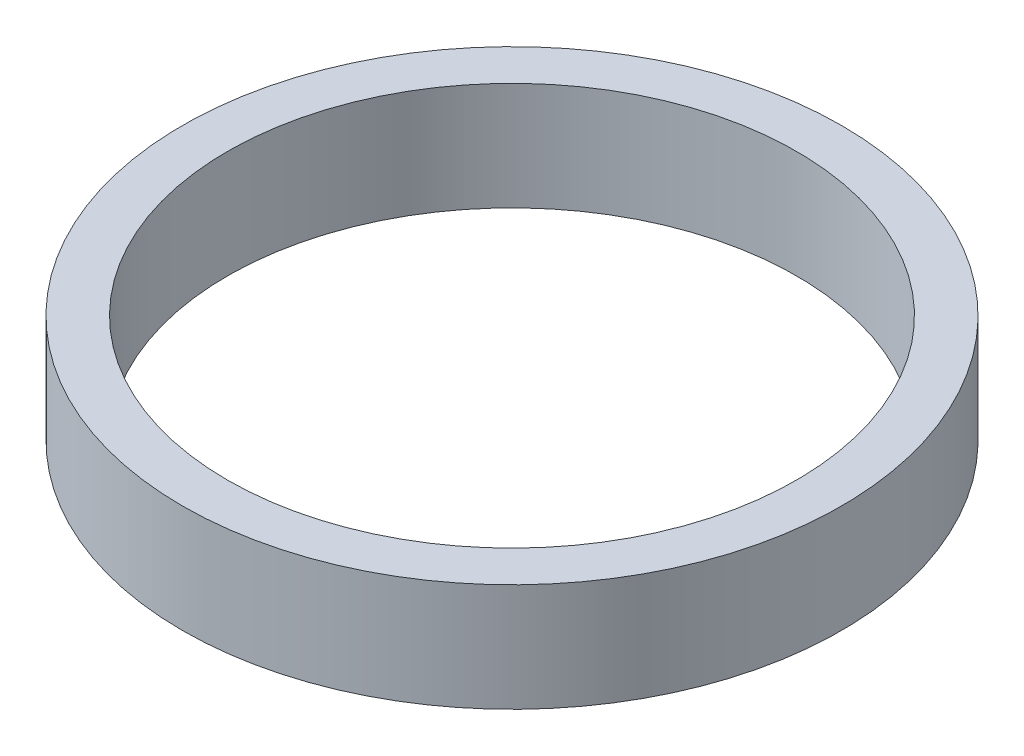
ISO-10303-21;
HEADER;
FILE_DESCRIPTION(('STEP AP214'),'2;1');
FILE_NAME('part.step','',(''),(''),'','','');
FILE_SCHEMA(('AUTOMOTIVE_DESIGN { 1 0 10303 214 1 1 1 1 }'));
ENDSEC;
DATA;
#1=APPLICATION_CONTEXT('core data for automotive mechanical design processes');
#2=APPLICATION_PROTOCOL_DEFINITION('international standard','automotive_design',2000,#1);
#3=PRODUCT_CONTEXT('',#1,'mechanical');
#4=PRODUCT('Part','Part','',(#3));
#5=PRODUCT_RELATED_PRODUCT_CATEGORY('part','',(#4));
#6=PRODUCT_DEFINITION_FORMATION('','',#4);
#7=PRODUCT_DEFINITION_CONTEXT('part definition',#1,'design');
#8=PRODUCT_DEFINITION('design','',#6,#7);
#9=PRODUCT_DEFINITION_SHAPE('','',#8);
#10=(LENGTH_UNIT() NAMED_UNIT(*) SI_UNIT(.MILLI.,.METRE.));
#11=(NAMED_UNIT(*) PLANE_ANGLE_UNIT() SI_UNIT($,.RADIAN.));
#12=(NAMED_UNIT(*) SI_UNIT($,.STERADIAN.) SOLID_ANGLE_UNIT());
#13=UNCERTAINTY_MEASURE_WITH_UNIT(LENGTH_MEASURE(1.E-05),#10,'distance_accuracy_value','');
#14=(GEOMETRIC_REPRESENTATION_CONTEXT(3) GLOBAL_UNCERTAINTY_ASSIGNED_CONTEXT((#13)) GLOBAL_UNIT_ASSIGNED_CONTEXT((#10,
#11,#12)) REPRESENTATION_CONTEXT('',''));
#15=CARTESIAN_POINT('',(0.,0.,0.));
#16=DIRECTION('',(0.,0.,1.));
#17=DIRECTION('',(1.,0.,0.));
#18=AXIS2_PLACEMENT_3D('',#15,#16,#17);
#19=CARTESIAN_POINT('',(0.,18.,0.));
#20=DIRECTION('',(0.,-1.,0.));
#21=DIRECTION('',(0.,0.,-1.));
#22=AXIS2_PLACEMENT_3D('',#19,#20,#21);
#23=CYLINDRICAL_SURFACE('',#22,55.);
#24=CARTESIAN_POINT('',(0.,18.,0.));
#25=DIRECTION('',(0.,1.,0.));
#26=DIRECTION('',(0.,0.,1.));
#27=AXIS2_PLACEMENT_3D('',#24,#25,#26);
#28=CIRCLE('',#27,55.);
#29=CARTESIAN_POINT('',(0.,18.,55.));
#30=VERTEX_POINT('',#29);
#31=EDGE_CURVE('E10',#30,#30,#28,.T.);
#32=ORIENTED_EDGE('',*,*,#31,.F.);
#33=EDGE_LOOP('',(#32));
#34=FACE_BOUND('',#33,.T.);
#35=CARTESIAN_POINT('',(0.,0.,0.));
#36=DIRECTION('',(0.,1.,0.));
#37=DIRECTION('',(0.,0.,1.));
#38=AXIS2_PLACEMENT_3D('',#35,#36,#37);
#39=CIRCLE('',#38,55.);
#40=CARTESIAN_POINT('',(0.,0.,55.));
#41=VERTEX_POINT('',#40);
#42=EDGE_CURVE('E37',#41,#41,#39,.T.);
#43=ORIENTED_EDGE('',*,*,#42,.T.);
#44=EDGE_LOOP('',(#43));
#45=FACE_BOUND('',#44,.T.);
#46=ADVANCED_FACE('F40',(#34,#45),#23,.T.);
#47=CARTESIAN_POINT('',(0.,18.,0.));
#48=DIRECTION('',(0.,1.,0.));
#49=DIRECTION('',(0.,0.,1.));
#50=AXIS2_PLACEMENT_3D('',#47,#48,#49);
#51=PLANE('',#50);
#52=CARTESIAN_POINT('',(0.,18.,0.));
#53=DIRECTION('',(0.,1.,0.));
#54=DIRECTION('',(0.,0.,1.));
#55=AXIS2_PLACEMENT_3D('',#52,#53,#54);
#56=CIRCLE('',#55,47.5);
#57=CARTESIAN_POINT('',(0.,18.,47.5));
#58=VERTEX_POINT('',#57);
#59=EDGE_CURVE('E50',#58,#58,#56,.T.);
#60=ORIENTED_EDGE('',*,*,#59,.F.);
#61=EDGE_LOOP('',(#60));
#62=FACE_BOUND('',#61,.T.);
#63=ORIENTED_EDGE('',*,*,#31,.T.);
#64=EDGE_LOOP('',(#63));
#65=FACE_BOUND('',#64,.T.);
#66=ADVANCED_FACE('F59',(#62,#65),#51,.T.);
#67=CARTESIAN_POINT('',(0.,0.,0.));
#68=DIRECTION('',(0.,1.,0.));
#69=DIRECTION('',(0.,0.,1.));
#70=AXIS2_PLACEMENT_3D('',#67,#68,#69);
#71=PLANE('',#70);
#72=CARTESIAN_POINT('',(0.,0.,0.));
#73=DIRECTION('',(0.,1.,0.));
#74=DIRECTION('',(0.,0.,1.));
#75=AXIS2_PLACEMENT_3D('',#72,#73,#74);
#76=CIRCLE('',#75,47.5);
#77=CARTESIAN_POINT('',(0.,0.,47.5));
#78=VERTEX_POINT('',#77);
#79=EDGE_CURVE('E47',#78,#78,#76,.T.);
#80=ORIENTED_EDGE('',*,*,#79,.T.);
#81=EDGE_LOOP('',(#80));
#82=FACE_BOUND('',#81,.T.);
#83=ORIENTED_EDGE('',*,*,#42,.F.);
#84=EDGE_LOOP('',(#83));
#85=FACE_BOUND('',#84,.T.);
#86=ADVANCED_FACE('F58',(#82,#85),#71,.F.);
#87=CARTESIAN_POINT('',(0.,18.,0.));
#88=DIRECTION('',(0.,-1.,0.));
#89=DIRECTION('',(0.,0.,-1.));
#90=AXIS2_PLACEMENT_3D('',#87,#88,#89);
#91=CYLINDRICAL_SURFACE('',#90,47.5);
#92=ORIENTED_EDGE('',*,*,#59,.T.);
#93=EDGE_LOOP('',(#92));
#94=FACE_BOUND('',#93,.T.);
#95=ORIENTED_EDGE('',*,*,#79,.F.);
#96=EDGE_LOOP('',(#95));
#97=FACE_BOUND('',#96,.T.);
#98=ADVANCED_FACE('F54',(#94,#97),#91,.F.);
#99=CLOSED_SHELL('',(#46,#66,#86,#98));
#100=MANIFOLD_SOLID_BREP('B2',#99);
#101=ADVANCED_BREP_SHAPE_REPRESENTATION('',(#18,#100),#14);
#102=SHAPE_DEFINITION_REPRESENTATION(#9,#101);
ENDSEC;
END-ISO-10303-21;
